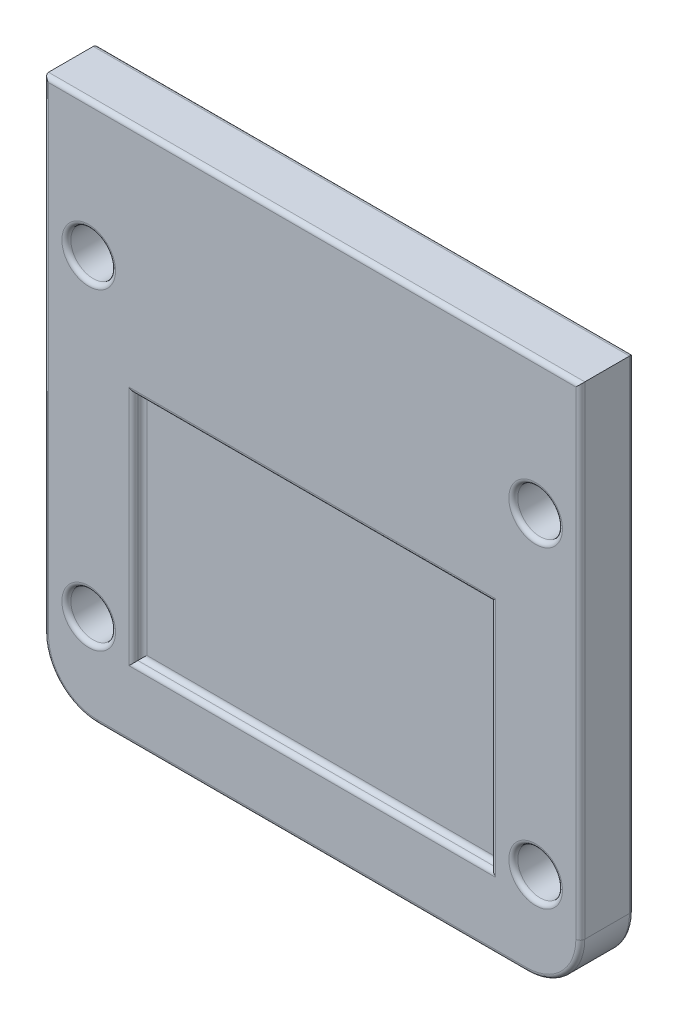
ISO-10303-21;
HEADER;
FILE_DESCRIPTION(('STEP AP214'),'2;1');
FILE_NAME('part.step','',(''),(''),'','','');
FILE_SCHEMA(('AUTOMOTIVE_DESIGN { 1 0 10303 214 1 1 1 1 }'));
ENDSEC;
DATA;
#1=APPLICATION_CONTEXT('core data for automotive mechanical design processes');
#2=APPLICATION_PROTOCOL_DEFINITION('international standard','automotive_design',2000,#1);
#3=PRODUCT_CONTEXT('',#1,'mechanical');
#4=PRODUCT('Part','Part','',(#3));
#5=PRODUCT_RELATED_PRODUCT_CATEGORY('part','',(#4));
#6=PRODUCT_DEFINITION_FORMATION('','',#4);
#7=PRODUCT_DEFINITION_CONTEXT('part definition',#1,'design');
#8=PRODUCT_DEFINITION('design','',#6,#7);
#9=PRODUCT_DEFINITION_SHAPE('','',#8);
#10=(LENGTH_UNIT() NAMED_UNIT(*) SI_UNIT(.MILLI.,.METRE.));
#11=(NAMED_UNIT(*) PLANE_ANGLE_UNIT() SI_UNIT($,.RADIAN.));
#12=(NAMED_UNIT(*) SI_UNIT($,.STERADIAN.) SOLID_ANGLE_UNIT());
#13=UNCERTAINTY_MEASURE_WITH_UNIT(LENGTH_MEASURE(1.E-05),#10,'distance_accuracy_value','');
#14=(GEOMETRIC_REPRESENTATION_CONTEXT(3) GLOBAL_UNCERTAINTY_ASSIGNED_CONTEXT((#13)) GLOBAL_UNIT_ASSIGNED_CONTEXT((#10,
#11,#12)) REPRESENTATION_CONTEXT('',''));
#15=CARTESIAN_POINT('',(0.,0.,0.));
#16=DIRECTION('',(0.,0.,1.));
#17=DIRECTION('',(1.,0.,0.));
#18=AXIS2_PLACEMENT_3D('',#15,#16,#17);
#19=CARTESIAN_POINT('',(0.,0.,6.));
#20=DIRECTION('',(1.,0.,0.));
#21=DIRECTION('',(0.,0.,-1.));
#22=AXIS2_PLACEMENT_3D('',#19,#20,#21);
#23=PLANE('',#22);
#24=DIRECTION('',(0.,0.,-1.));
#25=VECTOR('',#24,1.);
#26=CARTESIAN_POINT('',(0.,60.,6.));
#27=LINE('',#26,#25);
#28=CARTESIAN_POINT('',(0.,60.,5.5));
#29=VERTEX_POINT('',#28);
#30=CARTESIAN_POINT('',(0.,60.,0.5));
#31=VERTEX_POINT('',#30);
#32=EDGE_CURVE('E221',#29,#31,#27,.T.);
#33=ORIENTED_EDGE('',*,*,#32,.T.);
#34=DIRECTION('',(0.,-1.,0.));
#35=VECTOR('',#34,1.);
#36=CARTESIAN_POINT('',(0.,6.,0.5));
#37=LINE('',#36,#35);
#38=CARTESIAN_POINT('',(0.,6.,0.5));
#39=VERTEX_POINT('',#38);
#40=EDGE_CURVE('E324',#31,#39,#37,.T.);
#41=ORIENTED_EDGE('',*,*,#40,.T.);
#42=DIRECTION('',(0.,0.,-1.));
#43=VECTOR('',#42,1.);
#44=CARTESIAN_POINT('',(0.,6.,6.));
#45=LINE('',#44,#43);
#46=CARTESIAN_POINT('',(0.,6.,5.5));
#47=VERTEX_POINT('',#46);
#48=EDGE_CURVE('E367',#39,#47,#45,.F.);
#49=ORIENTED_EDGE('',*,*,#48,.T.);
#50=DIRECTION('',(0.,-1.,0.));
#51=VECTOR('',#50,1.);
#52=CARTESIAN_POINT('',(0.,0.,5.5));
#53=LINE('',#52,#51);
#54=EDGE_CURVE('E326',#47,#29,#53,.F.);
#55=ORIENTED_EDGE('',*,*,#54,.T.);
#56=EDGE_LOOP('',(#33,#41,#49,#55));
#57=FACE_BOUND('',#56,.T.);
#58=ADVANCED_FACE('F32',(#57),#23,.F.);
#59=CARTESIAN_POINT('',(0.,0.,6.));
#60=DIRECTION('',(0.,1.,0.));
#61=DIRECTION('',(0.,0.,1.));
#62=AXIS2_PLACEMENT_3D('',#59,#60,#61);
#63=PLANE('',#62);
#64=DIRECTION('',(0.,0.,-1.));
#65=VECTOR('',#64,1.);
#66=CARTESIAN_POINT('',(6.,0.,6.));
#67=LINE('',#66,#65);
#68=CARTESIAN_POINT('',(6.,0.,5.5));
#69=VERTEX_POINT('',#68);
#70=CARTESIAN_POINT('',(6.,0.,0.5));
#71=VERTEX_POINT('',#70);
#72=EDGE_CURVE('E372',#69,#71,#67,.T.);
#73=ORIENTED_EDGE('',*,*,#72,.T.);
#74=DIRECTION('',(1.,0.,0.));
#75=VECTOR('',#74,1.);
#76=CARTESIAN_POINT('',(54.,0.,0.5));
#77=LINE('',#76,#75);
#78=CARTESIAN_POINT('',(54.,0.,0.5));
#79=VERTEX_POINT('',#78);
#80=EDGE_CURVE('E254',#71,#79,#77,.T.);
#81=ORIENTED_EDGE('',*,*,#80,.T.);
#82=DIRECTION('',(0.,0.,-1.));
#83=VECTOR('',#82,1.);
#84=CARTESIAN_POINT('',(54.,0.,6.));
#85=LINE('',#84,#83);
#86=CARTESIAN_POINT('',(54.,0.,5.5));
#87=VERTEX_POINT('',#86);
#88=EDGE_CURVE('E370',#79,#87,#85,.F.);
#89=ORIENTED_EDGE('',*,*,#88,.T.);
#90=DIRECTION('',(1.,0.,0.));
#91=VECTOR('',#90,1.);
#92=CARTESIAN_POINT('',(0.,0.,5.5));
#93=LINE('',#92,#91);
#94=EDGE_CURVE('E257',#87,#69,#93,.F.);
#95=ORIENTED_EDGE('',*,*,#94,.T.);
#96=EDGE_LOOP('',(#73,#81,#89,#95));
#97=FACE_BOUND('',#96,.T.);
#98=ADVANCED_FACE('F399',(#97),#63,.F.);
#99=CARTESIAN_POINT('',(60.,0.,6.));
#100=DIRECTION('',(-1.,0.,0.));
#101=DIRECTION('',(0.,0.,1.));
#102=AXIS2_PLACEMENT_3D('',#99,#100,#101);
#103=PLANE('',#102);
#104=DIRECTION('',(0.,0.,-1.));
#105=VECTOR('',#104,1.);
#106=CARTESIAN_POINT('',(60.,6.,6.));
#107=LINE('',#106,#105);
#108=CARTESIAN_POINT('',(60.,6.,5.5));
#109=VERTEX_POINT('',#108);
#110=CARTESIAN_POINT('',(60.,6.,0.5));
#111=VERTEX_POINT('',#110);
#112=EDGE_CURVE('E374',#109,#111,#107,.T.);
#113=ORIENTED_EDGE('',*,*,#112,.T.);
#114=DIRECTION('',(0.,1.,0.));
#115=VECTOR('',#114,1.);
#116=CARTESIAN_POINT('',(60.,60.,0.5));
#117=LINE('',#116,#115);
#118=CARTESIAN_POINT('',(60.,60.,0.5));
#119=VERTEX_POINT('',#118);
#120=EDGE_CURVE('E262',#111,#119,#117,.T.);
#121=ORIENTED_EDGE('',*,*,#120,.T.);
#122=DIRECTION('',(0.,0.,-1.));
#123=VECTOR('',#122,1.);
#124=CARTESIAN_POINT('',(60.,60.,6.));
#125=LINE('',#124,#123);
#126=CARTESIAN_POINT('',(60.,60.,5.5));
#127=VERTEX_POINT('',#126);
#128=EDGE_CURVE('E377',#127,#119,#125,.T.);
#129=ORIENTED_EDGE('',*,*,#128,.F.);
#130=DIRECTION('',(0.,1.,0.));
#131=VECTOR('',#130,1.);
#132=CARTESIAN_POINT('',(60.,0.,5.5));
#133=LINE('',#132,#131);
#134=EDGE_CURVE('E181',#127,#109,#133,.F.);
#135=ORIENTED_EDGE('',*,*,#134,.T.);
#136=EDGE_LOOP('',(#113,#121,#129,#135));
#137=FACE_BOUND('',#136,.T.);
#138=ADVANCED_FACE('F422',(#137),#103,.F.);
#139=CARTESIAN_POINT('',(0.,60.,6.));
#140=DIRECTION('',(0.,-1.,0.));
#141=DIRECTION('',(0.,0.,-1.));
#142=AXIS2_PLACEMENT_3D('',#139,#140,#141);
#143=PLANE('',#142);
#144=ORIENTED_EDGE('',*,*,#128,.T.);
#145=DIRECTION('',(-1.,0.,0.));
#146=VECTOR('',#145,1.);
#147=CARTESIAN_POINT('',(0.,60.,0.5));
#148=LINE('',#147,#146);
#149=EDGE_CURVE('E353',#119,#31,#148,.T.);
#150=ORIENTED_EDGE('',*,*,#149,.T.);
#151=ORIENTED_EDGE('',*,*,#32,.F.);
#152=DIRECTION('',(-1.,0.,0.));
#153=VECTOR('',#152,1.);
#154=CARTESIAN_POINT('',(0.,60.,5.5));
#155=LINE('',#154,#153);
#156=EDGE_CURVE('E356',#29,#127,#155,.F.);
#157=ORIENTED_EDGE('',*,*,#156,.T.);
#158=EDGE_LOOP('',(#144,#150,#151,#157));
#159=FACE_BOUND('',#158,.T.);
#160=ADVANCED_FACE('F387',(#159),#143,.F.);
#161=CARTESIAN_POINT('',(0.,0.,6.));
#162=DIRECTION('',(0.,0.,-1.));
#163=DIRECTION('',(-1.,0.,0.));
#164=AXIS2_PLACEMENT_3D('',#161,#162,#163);
#165=PLANE('',#164);
#166=DIRECTION('',(0.,-1.,0.));
#167=VECTOR('',#166,1.);
#168=CARTESIAN_POINT('',(0.5,0.,6.));
#169=LINE('',#168,#167);
#170=CARTESIAN_POINT('',(0.5,59.5,6.));
#171=VERTEX_POINT('',#170);
#172=CARTESIAN_POINT('',(0.5,6.,6.));
#173=VERTEX_POINT('',#172);
#174=EDGE_CURVE('E42',#171,#173,#169,.T.);
#175=ORIENTED_EDGE('',*,*,#174,.T.);
#176=CARTESIAN_POINT('',(6.,6.,6.));
#177=DIRECTION('',(0.,0.,-1.));
#178=DIRECTION('',(-1.,0.,0.));
#179=AXIS2_PLACEMENT_3D('',#176,#177,#178);
#180=CIRCLE('',#179,5.5);
#181=CARTESIAN_POINT('',(6.,0.5,6.));
#182=VERTEX_POINT('',#181);
#183=EDGE_CURVE('E11',#173,#182,#180,.F.);
#184=ORIENTED_EDGE('',*,*,#183,.T.);
#185=DIRECTION('',(1.,0.,0.));
#186=VECTOR('',#185,1.);
#187=CARTESIAN_POINT('',(0.,0.5,6.));
#188=LINE('',#187,#186);
#189=CARTESIAN_POINT('',(54.,0.5,6.));
#190=VERTEX_POINT('',#189);
#191=EDGE_CURVE('E309',#182,#190,#188,.T.);
#192=ORIENTED_EDGE('',*,*,#191,.T.);
#193=CARTESIAN_POINT('',(54.,6.,6.));
#194=DIRECTION('',(0.,0.,-1.));
#195=DIRECTION('',(-1.,0.,0.));
#196=AXIS2_PLACEMENT_3D('',#193,#194,#195);
#197=CIRCLE('',#196,5.5);
#198=CARTESIAN_POINT('',(59.5,6.,6.));
#199=VERTEX_POINT('',#198);
#200=EDGE_CURVE('E173',#190,#199,#197,.F.);
#201=ORIENTED_EDGE('',*,*,#200,.T.);
#202=DIRECTION('',(0.,1.,0.));
#203=VECTOR('',#202,1.);
#204=CARTESIAN_POINT('',(59.5,0.,6.));
#205=LINE('',#204,#203);
#206=CARTESIAN_POINT('',(59.5,59.5,6.));
#207=VERTEX_POINT('',#206);
#208=EDGE_CURVE('E165',#199,#207,#205,.T.);
#209=ORIENTED_EDGE('',*,*,#208,.T.);
#210=DIRECTION('',(-1.,0.,0.));
#211=VECTOR('',#210,1.);
#212=CARTESIAN_POINT('',(0.,59.5,6.));
#213=LINE('',#212,#211);
#214=EDGE_CURVE('E170',#207,#171,#213,.T.);
#215=ORIENTED_EDGE('',*,*,#214,.T.);
#216=EDGE_LOOP('',(#175,#184,#192,#201,#209,#215));
#217=FACE_BOUND('',#216,.T.);
#218=CARTESIAN_POINT('',(5.,45.,6.));
#219=DIRECTION('',(0.,0.,-1.));
#220=DIRECTION('',(-1.,0.,0.));
#221=AXIS2_PLACEMENT_3D('',#218,#219,#220);
#222=CIRCLE('',#221,3.);
#223=CARTESIAN_POINT('',(2.,45.,6.));
#224=VERTEX_POINT('',#223);
#225=EDGE_CURVE('E306',#224,#224,#222,.T.);
#226=ORIENTED_EDGE('',*,*,#225,.T.);
#227=EDGE_LOOP('',(#226));
#228=FACE_BOUND('',#227,.T.);
#229=CARTESIAN_POINT('',(55.,45.,6.));
#230=DIRECTION('',(0.,0.,-1.));
#231=DIRECTION('',(-1.,0.,0.));
#232=AXIS2_PLACEMENT_3D('',#229,#230,#231);
#233=CIRCLE('',#232,3.);
#234=CARTESIAN_POINT('',(52.,45.,6.));
#235=VERTEX_POINT('',#234);
#236=EDGE_CURVE('E303',#235,#235,#233,.T.);
#237=ORIENTED_EDGE('',*,*,#236,.T.);
#238=EDGE_LOOP('',(#237));
#239=FACE_BOUND('',#238,.T.);
#240=CARTESIAN_POINT('',(55.,10.,6.));
#241=DIRECTION('',(0.,0.,-1.));
#242=DIRECTION('',(-1.,0.,0.));
#243=AXIS2_PLACEMENT_3D('',#240,#241,#242);
#244=CIRCLE('',#243,3.);
#245=CARTESIAN_POINT('',(52.,10.,6.));
#246=VERTEX_POINT('',#245);
#247=EDGE_CURVE('E300',#246,#246,#244,.T.);
#248=ORIENTED_EDGE('',*,*,#247,.T.);
#249=EDGE_LOOP('',(#248));
#250=FACE_BOUND('',#249,.T.);
#251=CARTESIAN_POINT('',(5.,10.,6.));
#252=DIRECTION('',(0.,0.,-1.));
#253=DIRECTION('',(-1.,0.,0.));
#254=AXIS2_PLACEMENT_3D('',#251,#252,#253);
#255=CIRCLE('',#254,3.);
#256=CARTESIAN_POINT('',(2.,10.,6.));
#257=VERTEX_POINT('',#256);
#258=EDGE_CURVE('E297',#257,#257,#255,.T.);
#259=ORIENTED_EDGE('',*,*,#258,.T.);
#260=EDGE_LOOP('',(#259));
#261=FACE_BOUND('',#260,.T.);
#262=DIRECTION('',(-1.,0.,0.));
#263=VECTOR('',#262,1.);
#264=CARTESIAN_POINT('',(0.,34.5,6.));
#265=LINE('',#264,#263);
#266=CARTESIAN_POINT('',(9.49999999999999,34.5,6.));
#267=VERTEX_POINT('',#266);
#268=CARTESIAN_POINT('',(50.5,34.5,6.));
#269=VERTEX_POINT('',#268);
#270=EDGE_CURVE('E292',#267,#269,#265,.F.);
#271=ORIENTED_EDGE('',*,*,#270,.T.);
#272=DIRECTION('',(0.,1.,0.));
#273=VECTOR('',#272,1.);
#274=CARTESIAN_POINT('',(50.5,0.,6.));
#275=LINE('',#274,#273);
#276=CARTESIAN_POINT('',(50.5,7.5,6.));
#277=VERTEX_POINT('',#276);
#278=EDGE_CURVE('E294',#269,#277,#275,.F.);
#279=ORIENTED_EDGE('',*,*,#278,.T.);
#280=DIRECTION('',(1.,0.,0.));
#281=VECTOR('',#280,1.);
#282=CARTESIAN_POINT('',(0.,7.5,6.));
#283=LINE('',#282,#281);
#284=CARTESIAN_POINT('',(9.5,7.5,6.));
#285=VERTEX_POINT('',#284);
#286=EDGE_CURVE('E288',#277,#285,#283,.F.);
#287=ORIENTED_EDGE('',*,*,#286,.T.);
#288=DIRECTION('',(0.,-1.,0.));
#289=VECTOR('',#288,1.);
#290=CARTESIAN_POINT('',(9.5,0.,6.));
#291=LINE('',#290,#289);
#292=EDGE_CURVE('E290',#285,#267,#291,.F.);
#293=ORIENTED_EDGE('',*,*,#292,.T.);
#294=EDGE_LOOP('',(#271,#279,#287,#293));
#295=FACE_BOUND('',#294,.T.);
#296=ADVANCED_FACE('F167',(#217,#228,#239,#250,#261,#295),#165,.F.);
#297=CARTESIAN_POINT('',(0.,0.,0.));
#298=DIRECTION('',(0.,0.,-1.));
#299=DIRECTION('',(-1.,0.,0.));
#300=AXIS2_PLACEMENT_3D('',#297,#298,#299);
#301=PLANE('',#300);
#302=DIRECTION('',(0.,-1.,0.));
#303=VECTOR('',#302,1.);
#304=CARTESIAN_POINT('',(0.5,60.,0.));
#305=LINE('',#304,#303);
#306=CARTESIAN_POINT('',(0.5,6.,0.));
#307=VERTEX_POINT('',#306);
#308=CARTESIAN_POINT('',(0.5,59.5,0.));
#309=VERTEX_POINT('',#308);
#310=EDGE_CURVE('E331',#307,#309,#305,.F.);
#311=ORIENTED_EDGE('',*,*,#310,.T.);
#312=DIRECTION('',(-1.,0.,0.));
#313=VECTOR('',#312,1.);
#314=CARTESIAN_POINT('',(60.,59.5,0.));
#315=LINE('',#314,#313);
#316=CARTESIAN_POINT('',(59.5,59.5,0.));
#317=VERTEX_POINT('',#316);
#318=EDGE_CURVE('E328',#309,#317,#315,.F.);
#319=ORIENTED_EDGE('',*,*,#318,.T.);
#320=DIRECTION('',(0.,1.,0.));
#321=VECTOR('',#320,1.);
#322=CARTESIAN_POINT('',(59.5,6.,0.));
#323=LINE('',#322,#321);
#324=CARTESIAN_POINT('',(59.5,6.,0.));
#325=VERTEX_POINT('',#324);
#326=EDGE_CURVE('E339',#317,#325,#323,.F.);
#327=ORIENTED_EDGE('',*,*,#326,.T.);
#328=CARTESIAN_POINT('',(54.,6.,0.));
#329=DIRECTION('',(0.,0.,-1.));
#330=DIRECTION('',(-1.,0.,0.));
#331=AXIS2_PLACEMENT_3D('',#328,#329,#330);
#332=CIRCLE('',#331,5.5);
#333=CARTESIAN_POINT('',(54.,0.5,0.));
#334=VERTEX_POINT('',#333);
#335=EDGE_CURVE('E337',#325,#334,#332,.T.);
#336=ORIENTED_EDGE('',*,*,#335,.T.);
#337=DIRECTION('',(1.,0.,0.));
#338=VECTOR('',#337,1.);
#339=CARTESIAN_POINT('',(6.,0.5,0.));
#340=LINE('',#339,#338);
#341=CARTESIAN_POINT('',(6.,0.5,0.));
#342=VERTEX_POINT('',#341);
#343=EDGE_CURVE('E335',#334,#342,#340,.F.);
#344=ORIENTED_EDGE('',*,*,#343,.T.);
#345=CARTESIAN_POINT('',(6.,6.,0.));
#346=DIRECTION('',(0.,0.,-1.));
#347=DIRECTION('',(-1.,0.,0.));
#348=AXIS2_PLACEMENT_3D('',#345,#346,#347);
#349=CIRCLE('',#348,5.5);
#350=EDGE_CURVE('E333',#342,#307,#349,.T.);
#351=ORIENTED_EDGE('',*,*,#350,.T.);
#352=EDGE_LOOP('',(#311,#319,#327,#336,#344,#351));
#353=FACE_BOUND('',#352,.T.);
#354=CARTESIAN_POINT('',(5.,45.,0.));
#355=DIRECTION('',(0.,0.,-1.));
#356=DIRECTION('',(-1.,0.,0.));
#357=AXIS2_PLACEMENT_3D('',#354,#355,#356);
#358=CIRCLE('',#357,3.);
#359=CARTESIAN_POINT('',(2.,45.,0.));
#360=VERTEX_POINT('',#359);
#361=EDGE_CURVE('E341',#360,#360,#358,.F.);
#362=ORIENTED_EDGE('',*,*,#361,.T.);
#363=EDGE_LOOP('',(#362));
#364=FACE_BOUND('',#363,.T.);
#365=CARTESIAN_POINT('',(55.,45.,0.));
#366=DIRECTION('',(0.,0.,-1.));
#367=DIRECTION('',(-1.,0.,0.));
#368=AXIS2_PLACEMENT_3D('',#365,#366,#367);
#369=CIRCLE('',#368,3.);
#370=CARTESIAN_POINT('',(52.,45.,0.));
#371=VERTEX_POINT('',#370);
#372=EDGE_CURVE('E344',#371,#371,#369,.F.);
#373=ORIENTED_EDGE('',*,*,#372,.T.);
#374=EDGE_LOOP('',(#373));
#375=FACE_BOUND('',#374,.T.);
#376=CARTESIAN_POINT('',(55.,10.,0.));
#377=DIRECTION('',(0.,0.,-1.));
#378=DIRECTION('',(-1.,0.,0.));
#379=AXIS2_PLACEMENT_3D('',#376,#377,#378);
#380=CIRCLE('',#379,3.);
#381=CARTESIAN_POINT('',(52.,10.,0.));
#382=VERTEX_POINT('',#381);
#383=EDGE_CURVE('E347',#382,#382,#380,.F.);
#384=ORIENTED_EDGE('',*,*,#383,.T.);
#385=EDGE_LOOP('',(#384));
#386=FACE_BOUND('',#385,.T.);
#387=CARTESIAN_POINT('',(5.,10.,0.));
#388=DIRECTION('',(0.,0.,-1.));
#389=DIRECTION('',(-1.,0.,0.));
#390=AXIS2_PLACEMENT_3D('',#387,#388,#389);
#391=CIRCLE('',#390,3.);
#392=CARTESIAN_POINT('',(2.,10.,0.));
#393=VERTEX_POINT('',#392);
#394=EDGE_CURVE('E350',#393,#393,#391,.F.);
#395=ORIENTED_EDGE('',*,*,#394,.T.);
#396=EDGE_LOOP('',(#395));
#397=FACE_BOUND('',#396,.T.);
#398=ADVANCED_FACE('F412',(#353,#364,#375,#386,#397),#301,.T.);
#399=CARTESIAN_POINT('',(5.,45.,6.));
#400=DIRECTION('',(0.,0.,1.));
#401=DIRECTION('',(1.,0.,0.));
#402=AXIS2_PLACEMENT_3D('',#399,#400,#401);
#403=CYLINDRICAL_SURFACE('',#402,2.5);
#404=CARTESIAN_POINT('',(5.,45.,0.5));
#405=DIRECTION('',(0.,0.,-1.));
#406=DIRECTION('',(-1.,0.,0.));
#407=AXIS2_PLACEMENT_3D('',#404,#405,#406);
#408=CIRCLE('',#407,2.5);
#409=CARTESIAN_POINT('',(2.5,45.,0.5));
#410=VERTEX_POINT('',#409);
#411=EDGE_CURVE('E267',#410,#410,#408,.T.);
#412=ORIENTED_EDGE('',*,*,#411,.T.);
#413=EDGE_LOOP('',(#412));
#414=FACE_BOUND('',#413,.T.);
#415=CARTESIAN_POINT('',(5.,45.,5.5));
#416=DIRECTION('',(0.,0.,-1.));
#417=DIRECTION('',(-1.,0.,0.));
#418=AXIS2_PLACEMENT_3D('',#415,#416,#417);
#419=CIRCLE('',#418,2.5);
#420=CARTESIAN_POINT('',(2.5,45.,5.5));
#421=VERTEX_POINT('',#420);
#422=EDGE_CURVE('E264',#421,#421,#419,.F.);
#423=ORIENTED_EDGE('',*,*,#422,.T.);
#424=EDGE_LOOP('',(#423));
#425=FACE_BOUND('',#424,.T.);
#426=ADVANCED_FACE('F508',(#414,#425),#403,.F.);
#427=CARTESIAN_POINT('',(55.,45.,6.));
#428=DIRECTION('',(0.,0.,1.));
#429=DIRECTION('',(1.,0.,0.));
#430=AXIS2_PLACEMENT_3D('',#427,#428,#429);
#431=CYLINDRICAL_SURFACE('',#430,2.5);
#432=CARTESIAN_POINT('',(55.,45.,0.5));
#433=DIRECTION('',(0.,0.,-1.));
#434=DIRECTION('',(-1.,0.,0.));
#435=AXIS2_PLACEMENT_3D('',#432,#433,#434);
#436=CIRCLE('',#435,2.5);
#437=CARTESIAN_POINT('',(52.5,45.,0.5));
#438=VERTEX_POINT('',#437);
#439=EDGE_CURVE('E273',#438,#438,#436,.T.);
#440=ORIENTED_EDGE('',*,*,#439,.T.);
#441=EDGE_LOOP('',(#440));
#442=FACE_BOUND('',#441,.T.);
#443=CARTESIAN_POINT('',(55.,45.,5.5));
#444=DIRECTION('',(0.,0.,-1.));
#445=DIRECTION('',(-1.,0.,0.));
#446=AXIS2_PLACEMENT_3D('',#443,#444,#445);
#447=CIRCLE('',#446,2.5);
#448=CARTESIAN_POINT('',(52.5,45.,5.5));
#449=VERTEX_POINT('',#448);
#450=EDGE_CURVE('E270',#449,#449,#447,.F.);
#451=ORIENTED_EDGE('',*,*,#450,.T.);
#452=EDGE_LOOP('',(#451));
#453=FACE_BOUND('',#452,.T.);
#454=ADVANCED_FACE('F541',(#442,#453),#431,.F.);
#455=CARTESIAN_POINT('',(55.,10.,6.));
#456=DIRECTION('',(0.,0.,1.));
#457=DIRECTION('',(1.,0.,0.));
#458=AXIS2_PLACEMENT_3D('',#455,#456,#457);
#459=CYLINDRICAL_SURFACE('',#458,2.5);
#460=CARTESIAN_POINT('',(55.,10.,0.5));
#461=DIRECTION('',(0.,0.,-1.));
#462=DIRECTION('',(-1.,0.,0.));
#463=AXIS2_PLACEMENT_3D('',#460,#461,#462);
#464=CIRCLE('',#463,2.5);
#465=CARTESIAN_POINT('',(52.5,10.,0.5));
#466=VERTEX_POINT('',#465);
#467=EDGE_CURVE('E279',#466,#466,#464,.T.);
#468=ORIENTED_EDGE('',*,*,#467,.T.);
#469=EDGE_LOOP('',(#468));
#470=FACE_BOUND('',#469,.T.);
#471=CARTESIAN_POINT('',(55.,10.,5.5));
#472=DIRECTION('',(0.,0.,-1.));
#473=DIRECTION('',(-1.,0.,0.));
#474=AXIS2_PLACEMENT_3D('',#471,#472,#473);
#475=CIRCLE('',#474,2.5);
#476=CARTESIAN_POINT('',(52.5,10.,5.5));
#477=VERTEX_POINT('',#476);
#478=EDGE_CURVE('E276',#477,#477,#475,.F.);
#479=ORIENTED_EDGE('',*,*,#478,.T.);
#480=EDGE_LOOP('',(#479));
#481=FACE_BOUND('',#480,.T.);
#482=ADVANCED_FACE('F550',(#470,#481),#459,.F.);
#483=CARTESIAN_POINT('',(5.,10.,6.));
#484=DIRECTION('',(0.,0.,1.));
#485=DIRECTION('',(1.,0.,0.));
#486=AXIS2_PLACEMENT_3D('',#483,#484,#485);
#487=CYLINDRICAL_SURFACE('',#486,2.5);
#488=CARTESIAN_POINT('',(5.,10.,0.5));
#489=DIRECTION('',(0.,0.,-1.));
#490=DIRECTION('',(-1.,0.,0.));
#491=AXIS2_PLACEMENT_3D('',#488,#489,#490);
#492=CIRCLE('',#491,2.5);
#493=CARTESIAN_POINT('',(2.5,10.,0.5));
#494=VERTEX_POINT('',#493);
#495=EDGE_CURVE('E285',#494,#494,#492,.T.);
#496=ORIENTED_EDGE('',*,*,#495,.T.);
#497=EDGE_LOOP('',(#496));
#498=FACE_BOUND('',#497,.T.);
#499=CARTESIAN_POINT('',(5.,10.,5.5));
#500=DIRECTION('',(0.,0.,-1.));
#501=DIRECTION('',(-1.,0.,0.));
#502=AXIS2_PLACEMENT_3D('',#499,#500,#501);
#503=CIRCLE('',#502,2.5);
#504=CARTESIAN_POINT('',(2.5,10.,5.5));
#505=VERTEX_POINT('',#504);
#506=EDGE_CURVE('E282',#505,#505,#503,.F.);
#507=ORIENTED_EDGE('',*,*,#506,.T.);
#508=EDGE_LOOP('',(#507));
#509=FACE_BOUND('',#508,.T.);
#510=ADVANCED_FACE('F451',(#498,#509),#487,.F.);
#511=CARTESIAN_POINT('',(54.,6.,6.));
#512=DIRECTION('',(0.,0.,-1.));
#513=DIRECTION('',(-1.,0.,0.));
#514=AXIS2_PLACEMENT_3D('',#511,#512,#513);
#515=CYLINDRICAL_SURFACE('',#514,6.);
#516=ORIENTED_EDGE('',*,*,#88,.F.);
#517=CARTESIAN_POINT('',(54.,6.,0.5));
#518=DIRECTION('',(0.,0.,-1.));
#519=DIRECTION('',(-1.,0.,0.));
#520=AXIS2_PLACEMENT_3D('',#517,#518,#519);
#521=CIRCLE('',#520,6.);
#522=EDGE_CURVE('E253',#79,#111,#521,.F.);
#523=ORIENTED_EDGE('',*,*,#522,.T.);
#524=ORIENTED_EDGE('',*,*,#112,.F.);
#525=CARTESIAN_POINT('',(54.,6.,5.5));
#526=DIRECTION('',(0.,0.,-1.));
#527=DIRECTION('',(-1.,0.,0.));
#528=AXIS2_PLACEMENT_3D('',#525,#526,#527);
#529=CIRCLE('',#528,6.);
#530=EDGE_CURVE('E247',#109,#87,#529,.T.);
#531=ORIENTED_EDGE('',*,*,#530,.T.);
#532=EDGE_LOOP('',(#516,#523,#524,#531));
#533=FACE_BOUND('',#532,.T.);
#534=ADVANCED_FACE('F420',(#533),#515,.T.);
#535=CARTESIAN_POINT('',(6.,6.,6.));
#536=DIRECTION('',(0.,0.,-1.));
#537=DIRECTION('',(-1.,0.,0.));
#538=AXIS2_PLACEMENT_3D('',#535,#536,#537);
#539=CYLINDRICAL_SURFACE('',#538,6.);
#540=ORIENTED_EDGE('',*,*,#48,.F.);
#541=CARTESIAN_POINT('',(6.,6.,0.5));
#542=DIRECTION('',(0.,0.,-1.));
#543=DIRECTION('',(-1.,0.,0.));
#544=AXIS2_PLACEMENT_3D('',#541,#542,#543);
#545=CIRCLE('',#544,6.);
#546=EDGE_CURVE('E318',#39,#71,#545,.F.);
#547=ORIENTED_EDGE('',*,*,#546,.T.);
#548=ORIENTED_EDGE('',*,*,#72,.F.);
#549=CARTESIAN_POINT('',(6.,6.,5.5));
#550=DIRECTION('',(0.,0.,-1.));
#551=DIRECTION('',(-1.,0.,0.));
#552=AXIS2_PLACEMENT_3D('',#549,#550,#551);
#553=CIRCLE('',#552,6.);
#554=EDGE_CURVE('E319',#69,#47,#553,.T.);
#555=ORIENTED_EDGE('',*,*,#554,.T.);
#556=EDGE_LOOP('',(#540,#547,#548,#555));
#557=FACE_BOUND('',#556,.T.);
#558=ADVANCED_FACE('F396',(#557),#539,.T.);
#559=CARTESIAN_POINT('',(0.,0.,5.));
#560=DIRECTION('',(0.,0.,1.));
#561=DIRECTION('',(1.,0.,0.));
#562=AXIS2_PLACEMENT_3D('',#559,#560,#561);
#563=PLANE('',#562);
#564=DIRECTION('',(0.,1.,0.));
#565=VECTOR('',#564,1.);
#566=CARTESIAN_POINT('',(49.5,0.,5.));
#567=LINE('',#566,#565);
#568=CARTESIAN_POINT('',(49.5,8.5,5.));
#569=VERTEX_POINT('',#568);
#570=CARTESIAN_POINT('',(49.5,33.5,5.));
#571=VERTEX_POINT('',#570);
#572=EDGE_CURVE('E361',#569,#571,#567,.T.);
#573=ORIENTED_EDGE('',*,*,#572,.T.);
#574=DIRECTION('',(-1.,0.,0.));
#575=VECTOR('',#574,1.);
#576=CARTESIAN_POINT('',(0.,33.5,5.));
#577=LINE('',#576,#575);
#578=CARTESIAN_POINT('',(10.5,33.5,5.));
#579=VERTEX_POINT('',#578);
#580=EDGE_CURVE('E358',#571,#579,#577,.T.);
#581=ORIENTED_EDGE('',*,*,#580,.T.);
#582=DIRECTION('',(0.,-1.,0.));
#583=VECTOR('',#582,1.);
#584=CARTESIAN_POINT('',(10.5,0.,5.));
#585=LINE('',#584,#583);
#586=CARTESIAN_POINT('',(10.5,8.5,5.));
#587=VERTEX_POINT('',#586);
#588=EDGE_CURVE('E365',#579,#587,#585,.T.);
#589=ORIENTED_EDGE('',*,*,#588,.T.);
#590=DIRECTION('',(1.,0.,0.));
#591=VECTOR('',#590,1.);
#592=CARTESIAN_POINT('',(0.,8.5,5.));
#593=LINE('',#592,#591);
#594=EDGE_CURVE('E363',#587,#569,#593,.T.);
#595=ORIENTED_EDGE('',*,*,#594,.T.);
#596=EDGE_LOOP('',(#573,#581,#589,#595));
#597=FACE_BOUND('',#596,.T.);
#598=ADVANCED_FACE('F454',(#597),#563,.T.);
#599=CARTESIAN_POINT('',(10.,7.5,5.5));
#600=DIRECTION('',(1.,0.,0.));
#601=DIRECTION('',(0.,0.,-1.));
#602=AXIS2_PLACEMENT_3D('',#599,#600,#601);
#603=CYLINDRICAL_SURFACE('',#602,0.5);
#604=CARTESIAN_POINT('',(9.5,7.5,5.5));
#605=DIRECTION('',(0.707106781186548,-0.707106781186547,0.));
#606=DIRECTION('',(-0.707106781186547,-0.707106781186548,0.));
#607=AXIS2_PLACEMENT_3D('',#604,#605,#606);
#608=ELLIPSE('',#607,0.707106781186547,0.5);
#609=CARTESIAN_POINT('',(10.,8.,5.5));
#610=VERTEX_POINT('',#609);
#611=EDGE_CURVE('E217',#285,#610,#608,.F.);
#612=ORIENTED_EDGE('',*,*,#611,.F.);
#613=ORIENTED_EDGE('',*,*,#286,.F.);
#614=CARTESIAN_POINT('',(50.5,7.5,5.5));
#615=DIRECTION('',(0.707106781186547,0.707106781186547,0.));
#616=DIRECTION('',(-0.707106781186547,0.707106781186547,0.));
#617=AXIS2_PLACEMENT_3D('',#614,#615,#616);
#618=ELLIPSE('',#617,0.707106781186547,0.5);
#619=CARTESIAN_POINT('',(50.,8.,5.5));
#620=VERTEX_POINT('',#619);
#621=EDGE_CURVE('E71',#620,#277,#618,.T.);
#622=ORIENTED_EDGE('',*,*,#621,.F.);
#623=DIRECTION('',(1.,0.,0.));
#624=VECTOR('',#623,1.);
#625=CARTESIAN_POINT('',(10.,8.,5.5));
#626=LINE('',#625,#624);
#627=EDGE_CURVE('E66',#610,#620,#626,.T.);
#628=ORIENTED_EDGE('',*,*,#627,.F.);
#629=EDGE_LOOP('',(#612,#613,#622,#628));
#630=FACE_BOUND('',#629,.T.);
#631=ADVANCED_FACE('F481',(#630),#603,.T.);
#632=CARTESIAN_POINT('',(50.5,34.,5.5));
#633=DIRECTION('',(0.,1.,0.));
#634=DIRECTION('',(0.,0.,1.));
#635=AXIS2_PLACEMENT_3D('',#632,#633,#634);
#636=CYLINDRICAL_SURFACE('',#635,0.5);
#637=ORIENTED_EDGE('',*,*,#621,.T.);
#638=ORIENTED_EDGE('',*,*,#278,.F.);
#639=CARTESIAN_POINT('',(50.5,34.5,5.5));
#640=DIRECTION('',(-0.707106781186547,0.707106781186547,0.));
#641=DIRECTION('',(0.707106781186547,0.707106781186547,0.));
#642=AXIS2_PLACEMENT_3D('',#639,#640,#641);
#643=ELLIPSE('',#642,0.707106781186547,0.5);
#644=CARTESIAN_POINT('',(50.,34.,5.5));
#645=VERTEX_POINT('',#644);
#646=EDGE_CURVE('E212',#645,#269,#643,.T.);
#647=ORIENTED_EDGE('',*,*,#646,.F.);
#648=DIRECTION('',(0.,1.,0.));
#649=VECTOR('',#648,1.);
#650=CARTESIAN_POINT('',(50.,34.,5.5));
#651=LINE('',#650,#649);
#652=EDGE_CURVE('E209',#620,#645,#651,.T.);
#653=ORIENTED_EDGE('',*,*,#652,.F.);
#654=EDGE_LOOP('',(#637,#638,#647,#653));
#655=FACE_BOUND('',#654,.T.);
#656=ADVANCED_FACE('F477',(#655),#636,.T.);
#657=CARTESIAN_POINT('',(0.,8.5,5.5));
#658=DIRECTION('',(1.,0.,0.));
#659=DIRECTION('',(0.,0.,-1.));
#660=AXIS2_PLACEMENT_3D('',#657,#658,#659);
#661=CYLINDRICAL_SURFACE('',#660,0.5);
#662=CARTESIAN_POINT('',(10.5,8.5,5.5));
#663=DIRECTION('',(0.707106781186548,-0.707106781186547,0.));
#664=DIRECTION('',(0.707106781186547,0.707106781186548,0.));
#665=AXIS2_PLACEMENT_3D('',#662,#663,#664);
#666=ELLIPSE('',#665,0.707106781186547,0.5);
#667=EDGE_CURVE('E203',#610,#587,#666,.T.);
#668=ORIENTED_EDGE('',*,*,#667,.F.);
#669=ORIENTED_EDGE('',*,*,#627,.T.);
#670=CARTESIAN_POINT('',(49.5,8.5,5.5));
#671=DIRECTION('',(0.707106781186547,0.707106781186547,0.));
#672=DIRECTION('',(-0.707106781186547,0.707106781186547,0.));
#673=AXIS2_PLACEMENT_3D('',#670,#671,#672);
#674=ELLIPSE('',#673,0.707106781186547,0.5);
#675=EDGE_CURVE('E206',#569,#620,#674,.F.);
#676=ORIENTED_EDGE('',*,*,#675,.F.);
#677=ORIENTED_EDGE('',*,*,#594,.F.);
#678=EDGE_LOOP('',(#668,#669,#676,#677));
#679=FACE_BOUND('',#678,.T.);
#680=ADVANCED_FACE('F473',(#679),#661,.F.);
#681=CARTESIAN_POINT('',(9.49999999999999,34.,5.5));
#682=DIRECTION('',(0.,-1.,0.));
#683=DIRECTION('',(1.,0.,0.));
#684=AXIS2_PLACEMENT_3D('',#681,#682,#683);
#685=CYLINDRICAL_SURFACE('',#684,0.5);
#686=CARTESIAN_POINT('',(9.49999999999999,34.5,5.5));
#687=DIRECTION('',(-0.707106781186547,-0.707106781186548,0.));
#688=DIRECTION('',(-0.707106781186548,0.707106781186547,0.));
#689=AXIS2_PLACEMENT_3D('',#686,#687,#688);
#690=ELLIPSE('',#689,0.707106781186548,0.5);
#691=CARTESIAN_POINT('',(9.99999999999999,34.,5.5));
#692=VERTEX_POINT('',#691);
#693=EDGE_CURVE('E215',#267,#692,#690,.F.);
#694=ORIENTED_EDGE('',*,*,#693,.F.);
#695=ORIENTED_EDGE('',*,*,#292,.F.);
#696=ORIENTED_EDGE('',*,*,#611,.T.);
#697=DIRECTION('',(0.,-1.,0.));
#698=VECTOR('',#697,1.);
#699=CARTESIAN_POINT('',(9.99999999999999,34.,5.5));
#700=LINE('',#699,#698);
#701=EDGE_CURVE('E200',#692,#610,#700,.T.);
#702=ORIENTED_EDGE('',*,*,#701,.F.);
#703=EDGE_LOOP('',(#694,#695,#696,#702));
#704=FACE_BOUND('',#703,.T.);
#705=ADVANCED_FACE('F469',(#704),#685,.T.);
#706=CARTESIAN_POINT('',(9.99999999999999,34.5,5.5));
#707=DIRECTION('',(-1.,0.,0.));
#708=DIRECTION('',(0.,0.,1.));
#709=AXIS2_PLACEMENT_3D('',#706,#707,#708);
#710=CYLINDRICAL_SURFACE('',#709,0.5);
#711=ORIENTED_EDGE('',*,*,#270,.F.);
#712=ORIENTED_EDGE('',*,*,#693,.T.);
#713=DIRECTION('',(-1.,0.,0.));
#714=VECTOR('',#713,1.);
#715=CARTESIAN_POINT('',(9.99999999999999,34.,5.5));
#716=LINE('',#715,#714);
#717=EDGE_CURVE('E198',#645,#692,#716,.T.);
#718=ORIENTED_EDGE('',*,*,#717,.F.);
#719=ORIENTED_EDGE('',*,*,#646,.T.);
#720=EDGE_LOOP('',(#711,#712,#718,#719));
#721=FACE_BOUND('',#720,.T.);
#722=ADVANCED_FACE('F465',(#721),#710,.T.);
#723=CARTESIAN_POINT('',(49.5,0.,5.5));
#724=DIRECTION('',(0.,1.,0.));
#725=DIRECTION('',(0.,0.,1.));
#726=AXIS2_PLACEMENT_3D('',#723,#724,#725);
#727=CYLINDRICAL_SURFACE('',#726,0.5);
#728=ORIENTED_EDGE('',*,*,#675,.T.);
#729=ORIENTED_EDGE('',*,*,#652,.T.);
#730=CARTESIAN_POINT('',(49.5,33.5,5.5));
#731=DIRECTION('',(-0.707106781186547,0.707106781186547,0.));
#732=DIRECTION('',(-0.707106781186547,-0.707106781186547,0.));
#733=AXIS2_PLACEMENT_3D('',#730,#731,#732);
#734=ELLIPSE('',#733,0.707106781186547,0.5);
#735=EDGE_CURVE('E194',#571,#645,#734,.F.);
#736=ORIENTED_EDGE('',*,*,#735,.F.);
#737=ORIENTED_EDGE('',*,*,#572,.F.);
#738=EDGE_LOOP('',(#728,#729,#736,#737));
#739=FACE_BOUND('',#738,.T.);
#740=ADVANCED_FACE('F461',(#739),#727,.F.);
#741=CARTESIAN_POINT('',(10.5,0.,5.5));
#742=DIRECTION('',(0.,-1.,0.));
#743=DIRECTION('',(1.,0.,0.));
#744=AXIS2_PLACEMENT_3D('',#741,#742,#743);
#745=CYLINDRICAL_SURFACE('',#744,0.5);
#746=ORIENTED_EDGE('',*,*,#667,.T.);
#747=ORIENTED_EDGE('',*,*,#588,.F.);
#748=CARTESIAN_POINT('',(10.5,33.5,5.5));
#749=DIRECTION('',(-0.707106781186547,-0.707106781186548,0.));
#750=DIRECTION('',(-0.707106781186548,0.707106781186547,0.));
#751=AXIS2_PLACEMENT_3D('',#748,#749,#750);
#752=ELLIPSE('',#751,0.707106781186548,0.5);
#753=EDGE_CURVE('E79',#692,#579,#752,.T.);
#754=ORIENTED_EDGE('',*,*,#753,.F.);
#755=ORIENTED_EDGE('',*,*,#701,.T.);
#756=EDGE_LOOP('',(#746,#747,#754,#755));
#757=FACE_BOUND('',#756,.T.);
#758=ADVANCED_FACE('F458',(#757),#745,.F.);
#759=CARTESIAN_POINT('',(0.,33.5,5.5));
#760=DIRECTION('',(-1.,0.,0.));
#761=DIRECTION('',(0.,0.,1.));
#762=AXIS2_PLACEMENT_3D('',#759,#760,#761);
#763=CYLINDRICAL_SURFACE('',#762,0.5);
#764=ORIENTED_EDGE('',*,*,#735,.T.);
#765=ORIENTED_EDGE('',*,*,#717,.T.);
#766=ORIENTED_EDGE('',*,*,#753,.T.);
#767=ORIENTED_EDGE('',*,*,#580,.F.);
#768=EDGE_LOOP('',(#764,#765,#766,#767));
#769=FACE_BOUND('',#768,.T.);
#770=ADVANCED_FACE('F455',(#769),#763,.F.);
#771=CARTESIAN_POINT('',(0.,0.5,0.5));
#772=DIRECTION('',(-1.,0.,0.));
#773=DIRECTION('',(0.,0.,1.));
#774=AXIS2_PLACEMENT_3D('',#771,#772,#773);
#775=CYLINDRICAL_SURFACE('',#774,0.5);
#776=CARTESIAN_POINT('',(6.,0.5,0.5));
#777=DIRECTION('',(-1.,0.,0.));
#778=DIRECTION('',(0.,0.,1.));
#779=AXIS2_PLACEMENT_3D('',#776,#777,#778);
#780=CIRCLE('',#779,0.5);
#781=EDGE_CURVE('E231',#342,#71,#780,.T.);
#782=ORIENTED_EDGE('',*,*,#781,.F.);
#783=ORIENTED_EDGE('',*,*,#343,.F.);
#784=CARTESIAN_POINT('',(54.,0.5,0.5));
#785=DIRECTION('',(1.,0.,0.));
#786=DIRECTION('',(0.,0.,-1.));
#787=AXIS2_PLACEMENT_3D('',#784,#785,#786);
#788=CIRCLE('',#787,0.5);
#789=EDGE_CURVE('E195',#79,#334,#788,.T.);
#790=ORIENTED_EDGE('',*,*,#789,.F.);
#791=ORIENTED_EDGE('',*,*,#80,.F.);
#792=EDGE_LOOP('',(#782,#783,#790,#791));
#793=FACE_BOUND('',#792,.T.);
#794=ADVANCED_FACE('F403',(#793),#775,.T.);
#795=CARTESIAN_POINT('',(54.,6.,0.5));
#796=DIRECTION('',(0.,0.,-1.));
#797=DIRECTION('',(-1.,0.,0.));
#798=AXIS2_PLACEMENT_3D('',#795,#796,#797);
#799=TOROIDAL_SURFACE('',#798,5.5,0.5);
#800=ORIENTED_EDGE('',*,*,#789,.T.);
#801=ORIENTED_EDGE('',*,*,#335,.F.);
#802=CARTESIAN_POINT('',(59.5,6.,0.5));
#803=DIRECTION('',(0.,1.,0.));
#804=DIRECTION('',(0.,0.,1.));
#805=AXIS2_PLACEMENT_3D('',#802,#803,#804);
#806=CIRCLE('',#805,0.5);
#807=EDGE_CURVE('E228',#111,#325,#806,.T.);
#808=ORIENTED_EDGE('',*,*,#807,.F.);
#809=ORIENTED_EDGE('',*,*,#522,.F.);
#810=EDGE_LOOP('',(#800,#801,#808,#809));
#811=FACE_BOUND('',#810,.T.);
#812=ADVANCED_FACE('F417',(#811),#799,.T.);
#813=CARTESIAN_POINT('',(6.,6.,0.5));
#814=DIRECTION('',(0.,0.,-1.));
#815=DIRECTION('',(-1.,0.,0.));
#816=AXIS2_PLACEMENT_3D('',#813,#814,#815);
#817=TOROIDAL_SURFACE('',#816,5.5,0.5);
#818=ORIENTED_EDGE('',*,*,#781,.T.);
#819=ORIENTED_EDGE('',*,*,#546,.F.);
#820=CARTESIAN_POINT('',(0.5,6.,0.5));
#821=DIRECTION('',(0.,1.,0.));
#822=DIRECTION('',(0.,0.,1.));
#823=AXIS2_PLACEMENT_3D('',#820,#821,#822);
#824=CIRCLE('',#823,0.5);
#825=EDGE_CURVE('E225',#307,#39,#824,.T.);
#826=ORIENTED_EDGE('',*,*,#825,.F.);
#827=ORIENTED_EDGE('',*,*,#350,.F.);
#828=EDGE_LOOP('',(#818,#819,#826,#827));
#829=FACE_BOUND('',#828,.T.);
#830=ADVANCED_FACE('F408',(#829),#817,.T.);
#831=CARTESIAN_POINT('',(59.5,0.,0.5));
#832=DIRECTION('',(0.,-1.,0.));
#833=DIRECTION('',(0.,0.,-1.));
#834=AXIS2_PLACEMENT_3D('',#831,#832,#833);
#835=CYLINDRICAL_SURFACE('',#834,0.5);
#836=ORIENTED_EDGE('',*,*,#807,.T.);
#837=ORIENTED_EDGE('',*,*,#326,.F.);
#838=CARTESIAN_POINT('',(59.5,59.5,0.5));
#839=DIRECTION('',(0.707106781186547,-0.707106781186547,0.));
#840=DIRECTION('',(-0.707106781186547,-0.707106781186547,0.));
#841=AXIS2_PLACEMENT_3D('',#838,#839,#840);
#842=ELLIPSE('',#841,0.707106781186547,0.5);
#843=EDGE_CURVE('E223',#119,#317,#842,.F.);
#844=ORIENTED_EDGE('',*,*,#843,.F.);
#845=ORIENTED_EDGE('',*,*,#120,.F.);
#846=EDGE_LOOP('',(#836,#837,#844,#845));
#847=FACE_BOUND('',#846,.T.);
#848=ADVANCED_FACE('F426',(#847),#835,.T.);
#849=CARTESIAN_POINT('',(0.5,0.,0.5));
#850=DIRECTION('',(0.,1.,0.));
#851=DIRECTION('',(0.,0.,1.));
#852=AXIS2_PLACEMENT_3D('',#849,#850,#851);
#853=CYLINDRICAL_SURFACE('',#852,0.5);
#854=ORIENTED_EDGE('',*,*,#825,.T.);
#855=ORIENTED_EDGE('',*,*,#40,.F.);
#856=CARTESIAN_POINT('',(0.5,59.5,0.5));
#857=DIRECTION('',(0.707106781186547,0.707106781186547,0.));
#858=DIRECTION('',(-0.707106781186547,0.707106781186547,0.));
#859=AXIS2_PLACEMENT_3D('',#856,#857,#858);
#860=ELLIPSE('',#859,0.707106781186547,0.5);
#861=EDGE_CURVE('E184',#309,#31,#860,.T.);
#862=ORIENTED_EDGE('',*,*,#861,.F.);
#863=ORIENTED_EDGE('',*,*,#310,.F.);
#864=EDGE_LOOP('',(#854,#855,#862,#863));
#865=FACE_BOUND('',#864,.T.);
#866=ADVANCED_FACE('F431',(#865),#853,.T.);
#867=CARTESIAN_POINT('',(0.,59.5,0.5));
#868=DIRECTION('',(1.,0.,0.));
#869=DIRECTION('',(0.,0.,-1.));
#870=AXIS2_PLACEMENT_3D('',#867,#868,#869);
#871=CYLINDRICAL_SURFACE('',#870,0.5);
#872=ORIENTED_EDGE('',*,*,#843,.T.);
#873=ORIENTED_EDGE('',*,*,#318,.F.);
#874=ORIENTED_EDGE('',*,*,#861,.T.);
#875=ORIENTED_EDGE('',*,*,#149,.F.);
#876=EDGE_LOOP('',(#872,#873,#874,#875));
#877=FACE_BOUND('',#876,.T.);
#878=ADVANCED_FACE('F428',(#877),#871,.T.);
#879=CARTESIAN_POINT('',(5.,45.,0.5));
#880=DIRECTION('',(0.,0.,-1.));
#881=DIRECTION('',(-1.,0.,0.));
#882=AXIS2_PLACEMENT_3D('',#879,#880,#881);
#883=TOROIDAL_SURFACE('',#882,3.,0.5);
#884=ORIENTED_EDGE('',*,*,#411,.F.);
#885=EDGE_LOOP('',(#884));
#886=FACE_BOUND('',#885,.T.);
#887=ORIENTED_EDGE('',*,*,#361,.F.);
#888=EDGE_LOOP('',(#887));
#889=FACE_BOUND('',#888,.T.);
#890=ADVANCED_FACE('F438',(#886,#889),#883,.T.);
#891=CARTESIAN_POINT('',(55.,45.,0.5));
#892=DIRECTION('',(0.,0.,-1.));
#893=DIRECTION('',(-1.,0.,0.));
#894=AXIS2_PLACEMENT_3D('',#891,#892,#893);
#895=TOROIDAL_SURFACE('',#894,3.,0.5);
#896=ORIENTED_EDGE('',*,*,#439,.F.);
#897=EDGE_LOOP('',(#896));
#898=FACE_BOUND('',#897,.T.);
#899=ORIENTED_EDGE('',*,*,#372,.F.);
#900=EDGE_LOOP('',(#899));
#901=FACE_BOUND('',#900,.T.);
#902=ADVANCED_FACE('F681',(#898,#901),#895,.T.);
#903=CARTESIAN_POINT('',(55.,10.,0.5));
#904=DIRECTION('',(0.,0.,-1.));
#905=DIRECTION('',(-1.,0.,0.));
#906=AXIS2_PLACEMENT_3D('',#903,#904,#905);
#907=TOROIDAL_SURFACE('',#906,3.,0.5);
#908=ORIENTED_EDGE('',*,*,#467,.F.);
#909=EDGE_LOOP('',(#908));
#910=FACE_BOUND('',#909,.T.);
#911=ORIENTED_EDGE('',*,*,#383,.F.);
#912=EDGE_LOOP('',(#911));
#913=FACE_BOUND('',#912,.T.);
#914=ADVANCED_FACE('F691',(#910,#913),#907,.T.);
#915=CARTESIAN_POINT('',(5.,10.,0.5));
#916=DIRECTION('',(0.,0.,-1.));
#917=DIRECTION('',(-1.,0.,0.));
#918=AXIS2_PLACEMENT_3D('',#915,#916,#917);
#919=TOROIDAL_SURFACE('',#918,3.,0.5);
#920=ORIENTED_EDGE('',*,*,#495,.F.);
#921=EDGE_LOOP('',(#920));
#922=FACE_BOUND('',#921,.T.);
#923=ORIENTED_EDGE('',*,*,#394,.F.);
#924=EDGE_LOOP('',(#923));
#925=FACE_BOUND('',#924,.T.);
#926=ADVANCED_FACE('F701',(#922,#925),#919,.T.);
#927=CARTESIAN_POINT('',(59.5,0.,5.5));
#928=DIRECTION('',(0.,1.,0.));
#929=DIRECTION('',(0.,0.,1.));
#930=AXIS2_PLACEMENT_3D('',#927,#928,#929);
#931=CYLINDRICAL_SURFACE('',#930,0.5);
#932=CARTESIAN_POINT('',(59.5,6.,5.5));
#933=DIRECTION('',(0.,-1.,0.));
#934=DIRECTION('',(0.,0.,-1.));
#935=AXIS2_PLACEMENT_3D('',#932,#933,#934);
#936=CIRCLE('',#935,0.5);
#937=EDGE_CURVE('E185',#109,#199,#936,.T.);
#938=ORIENTED_EDGE('',*,*,#937,.F.);
#939=ORIENTED_EDGE('',*,*,#134,.F.);
#940=CARTESIAN_POINT('',(59.5,59.5,5.5));
#941=DIRECTION('',(-0.707106781186547,0.707106781186547,0.));
#942=DIRECTION('',(0.707106781186547,0.707106781186547,0.));
#943=AXIS2_PLACEMENT_3D('',#940,#941,#942);
#944=ELLIPSE('',#943,0.707106781186547,0.5);
#945=EDGE_CURVE('E36',#207,#127,#944,.T.);
#946=ORIENTED_EDGE('',*,*,#945,.F.);
#947=ORIENTED_EDGE('',*,*,#208,.F.);
#948=EDGE_LOOP('',(#938,#939,#946,#947));
#949=FACE_BOUND('',#948,.T.);
#950=ADVANCED_FACE('F180',(#949),#931,.T.);
#951=CARTESIAN_POINT('',(0.,59.5,5.5));
#952=DIRECTION('',(-1.,0.,0.));
#953=DIRECTION('',(0.,0.,1.));
#954=AXIS2_PLACEMENT_3D('',#951,#952,#953);
#955=CYLINDRICAL_SURFACE('',#954,0.5);
#956=ORIENTED_EDGE('',*,*,#945,.T.);
#957=ORIENTED_EDGE('',*,*,#156,.F.);
#958=CARTESIAN_POINT('',(0.5,59.5,5.5));
#959=DIRECTION('',(-0.707106781186547,-0.707106781186547,0.));
#960=DIRECTION('',(-0.707106781186547,0.707106781186547,0.));
#961=AXIS2_PLACEMENT_3D('',#958,#959,#960);
#962=ELLIPSE('',#961,0.707106781186547,0.5);
#963=EDGE_CURVE('E188',#171,#29,#962,.T.);
#964=ORIENTED_EDGE('',*,*,#963,.F.);
#965=ORIENTED_EDGE('',*,*,#214,.F.);
#966=EDGE_LOOP('',(#956,#957,#964,#965));
#967=FACE_BOUND('',#966,.T.);
#968=ADVANCED_FACE('F186',(#967),#955,.T.);
#969=CARTESIAN_POINT('',(54.,6.,5.5));
#970=DIRECTION('',(0.,0.,-1.));
#971=DIRECTION('',(-1.,0.,0.));
#972=AXIS2_PLACEMENT_3D('',#969,#970,#971);
#973=TOROIDAL_SURFACE('',#972,5.5,0.5);
#974=ORIENTED_EDGE('',*,*,#937,.T.);
#975=ORIENTED_EDGE('',*,*,#200,.F.);
#976=CARTESIAN_POINT('',(54.,0.5,5.5));
#977=DIRECTION('',(-1.,0.,0.));
#978=DIRECTION('',(0.,0.,1.));
#979=AXIS2_PLACEMENT_3D('',#976,#977,#978);
#980=CIRCLE('',#979,0.5);
#981=EDGE_CURVE('E240',#87,#190,#980,.T.);
#982=ORIENTED_EDGE('',*,*,#981,.F.);
#983=ORIENTED_EDGE('',*,*,#530,.F.);
#984=EDGE_LOOP('',(#974,#975,#982,#983));
#985=FACE_BOUND('',#984,.T.);
#986=ADVANCED_FACE('F245',(#985),#973,.T.);
#987=CARTESIAN_POINT('',(0.5,0.,5.5));
#988=DIRECTION('',(0.,-1.,0.));
#989=DIRECTION('',(0.,0.,-1.));
#990=AXIS2_PLACEMENT_3D('',#987,#988,#989);
#991=CYLINDRICAL_SURFACE('',#990,0.5);
#992=ORIENTED_EDGE('',*,*,#963,.T.);
#993=ORIENTED_EDGE('',*,*,#54,.F.);
#994=CARTESIAN_POINT('',(0.5,6.,5.5));
#995=DIRECTION('',(0.,-1.,0.));
#996=DIRECTION('',(0.,0.,-1.));
#997=AXIS2_PLACEMENT_3D('',#994,#995,#996);
#998=CIRCLE('',#997,0.5);
#999=EDGE_CURVE('E238',#173,#47,#998,.T.);
#1000=ORIENTED_EDGE('',*,*,#999,.F.);
#1001=ORIENTED_EDGE('',*,*,#174,.F.);
#1002=EDGE_LOOP('',(#992,#993,#1000,#1001));
#1003=FACE_BOUND('',#1002,.T.);
#1004=ADVANCED_FACE('F391',(#1003),#991,.T.);
#1005=CARTESIAN_POINT('',(0.,0.5,5.5));
#1006=DIRECTION('',(1.,0.,0.));
#1007=DIRECTION('',(0.,0.,-1.));
#1008=AXIS2_PLACEMENT_3D('',#1005,#1006,#1007);
#1009=CYLINDRICAL_SURFACE('',#1008,0.5);
#1010=ORIENTED_EDGE('',*,*,#981,.T.);
#1011=ORIENTED_EDGE('',*,*,#191,.F.);
#1012=CARTESIAN_POINT('',(6.,0.5,5.5));
#1013=DIRECTION('',(-1.,0.,0.));
#1014=DIRECTION('',(0.,0.,1.));
#1015=AXIS2_PLACEMENT_3D('',#1012,#1013,#1014);
#1016=CIRCLE('',#1015,0.5);
#1017=EDGE_CURVE('E236',#69,#182,#1016,.T.);
#1018=ORIENTED_EDGE('',*,*,#1017,.F.);
#1019=ORIENTED_EDGE('',*,*,#94,.F.);
#1020=EDGE_LOOP('',(#1010,#1011,#1018,#1019));
#1021=FACE_BOUND('',#1020,.T.);
#1022=ADVANCED_FACE('F314',(#1021),#1009,.T.);
#1023=CARTESIAN_POINT('',(6.,6.,5.5));
#1024=DIRECTION('',(0.,0.,-1.));
#1025=DIRECTION('',(-1.,0.,0.));
#1026=AXIS2_PLACEMENT_3D('',#1023,#1024,#1025);
#1027=TOROIDAL_SURFACE('',#1026,5.5,0.5);
#1028=ORIENTED_EDGE('',*,*,#999,.T.);
#1029=ORIENTED_EDGE('',*,*,#554,.F.);
#1030=ORIENTED_EDGE('',*,*,#1017,.T.);
#1031=ORIENTED_EDGE('',*,*,#183,.F.);
#1032=EDGE_LOOP('',(#1028,#1029,#1030,#1031));
#1033=FACE_BOUND('',#1032,.T.);
#1034=ADVANCED_FACE('F394',(#1033),#1027,.T.);
#1035=CARTESIAN_POINT('',(5.,45.,5.5));
#1036=DIRECTION('',(0.,0.,-1.));
#1037=DIRECTION('',(-1.,0.,0.));
#1038=AXIS2_PLACEMENT_3D('',#1035,#1036,#1037);
#1039=TOROIDAL_SURFACE('',#1038,3.,0.5);
#1040=ORIENTED_EDGE('',*,*,#225,.F.);
#1041=EDGE_LOOP('',(#1040));
#1042=FACE_BOUND('',#1041,.T.);
#1043=ORIENTED_EDGE('',*,*,#422,.F.);
#1044=EDGE_LOOP('',(#1043));
#1045=FACE_BOUND('',#1044,.T.);
#1046=ADVANCED_FACE('F760',(#1042,#1045),#1039,.T.);
#1047=CARTESIAN_POINT('',(55.,45.,5.5));
#1048=DIRECTION('',(0.,0.,-1.));
#1049=DIRECTION('',(-1.,0.,0.));
#1050=AXIS2_PLACEMENT_3D('',#1047,#1048,#1049);
#1051=TOROIDAL_SURFACE('',#1050,3.,0.5);
#1052=ORIENTED_EDGE('',*,*,#236,.F.);
#1053=EDGE_LOOP('',(#1052));
#1054=FACE_BOUND('',#1053,.T.);
#1055=ORIENTED_EDGE('',*,*,#450,.F.);
#1056=EDGE_LOOP('',(#1055));
#1057=FACE_BOUND('',#1056,.T.);
#1058=ADVANCED_FACE('F769',(#1054,#1057),#1051,.T.);
#1059=CARTESIAN_POINT('',(55.,10.,5.5));
#1060=DIRECTION('',(0.,0.,-1.));
#1061=DIRECTION('',(-1.,0.,0.));
#1062=AXIS2_PLACEMENT_3D('',#1059,#1060,#1061);
#1063=TOROIDAL_SURFACE('',#1062,3.,0.5);
#1064=ORIENTED_EDGE('',*,*,#247,.F.);
#1065=EDGE_LOOP('',(#1064));
#1066=FACE_BOUND('',#1065,.T.);
#1067=ORIENTED_EDGE('',*,*,#478,.F.);
#1068=EDGE_LOOP('',(#1067));
#1069=FACE_BOUND('',#1068,.T.);
#1070=ADVANCED_FACE('F779',(#1066,#1069),#1063,.T.);
#1071=CARTESIAN_POINT('',(5.,10.,5.5));
#1072=DIRECTION('',(0.,0.,-1.));
#1073=DIRECTION('',(-1.,0.,0.));
#1074=AXIS2_PLACEMENT_3D('',#1071,#1072,#1073);
#1075=TOROIDAL_SURFACE('',#1074,3.,0.5);
#1076=ORIENTED_EDGE('',*,*,#258,.F.);
#1077=EDGE_LOOP('',(#1076));
#1078=FACE_BOUND('',#1077,.T.);
#1079=ORIENTED_EDGE('',*,*,#506,.F.);
#1080=EDGE_LOOP('',(#1079));
#1081=FACE_BOUND('',#1080,.T.);
#1082=ADVANCED_FACE('F34',(#1078,#1081),#1075,.T.);
#1083=CLOSED_SHELL('',(#58,#98,#138,#160,#296,#398,#426,#454,#482,#510,#534,#558,#598,#631,#656,
#680,#705,#722,#740,#758,#770,#794,#812,#830,#848,#866,#878,#890,#902,#914,#926,#950,#968,#986,
#1004,#1022,#1034,#1046,#1058,#1070,#1082));
#1084=MANIFOLD_SOLID_BREP('B2',#1083);
#1085=ADVANCED_BREP_SHAPE_REPRESENTATION('',(#18,#1084),#14);
#1086=SHAPE_DEFINITION_REPRESENTATION(#9,#1085);
ENDSEC;
END-ISO-10303-21;
